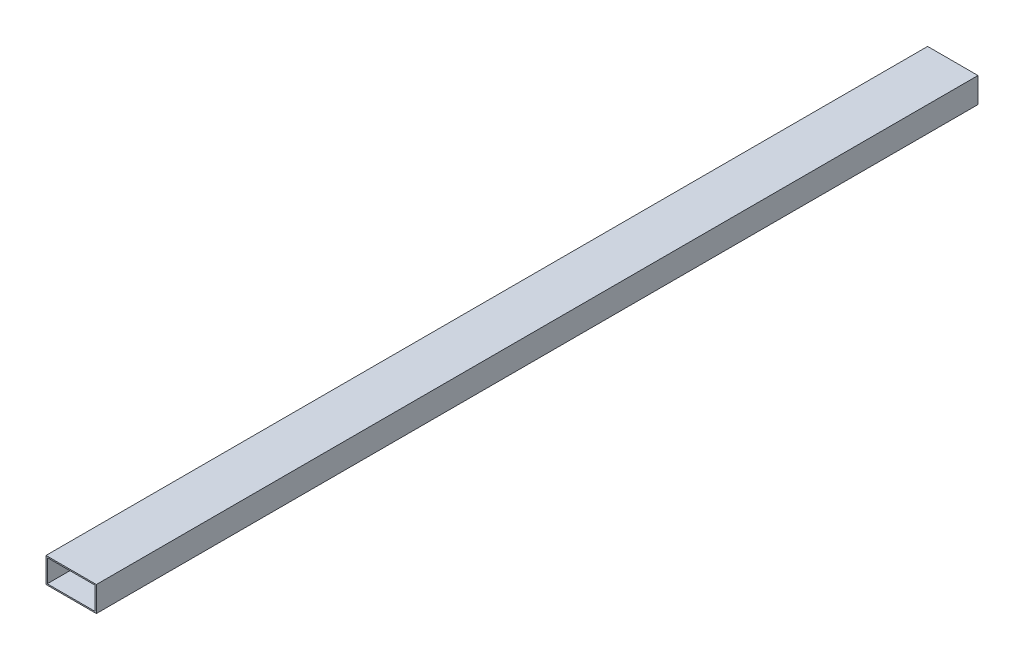
ISO-10303-21;
HEADER;
FILE_DESCRIPTION(('STEP AP214'),'2;1');
FILE_NAME('part.step','',(''),(''),'','','');
FILE_SCHEMA(('AUTOMOTIVE_DESIGN { 1 0 10303 214 1 1 1 1 }'));
ENDSEC;
DATA;
#1=APPLICATION_CONTEXT('core data for automotive mechanical design processes');
#2=APPLICATION_PROTOCOL_DEFINITION('international standard','automotive_design',2000,#1);
#3=PRODUCT_CONTEXT('',#1,'mechanical');
#4=PRODUCT('Part','Part','',(#3));
#5=PRODUCT_RELATED_PRODUCT_CATEGORY('part','',(#4));
#6=PRODUCT_DEFINITION_FORMATION('','',#4);
#7=PRODUCT_DEFINITION_CONTEXT('part definition',#1,'design');
#8=PRODUCT_DEFINITION('design','',#6,#7);
#9=PRODUCT_DEFINITION_SHAPE('','',#8);
#10=(LENGTH_UNIT() NAMED_UNIT(*) SI_UNIT(.MILLI.,.METRE.));
#11=(NAMED_UNIT(*) PLANE_ANGLE_UNIT() SI_UNIT($,.RADIAN.));
#12=(NAMED_UNIT(*) SI_UNIT($,.STERADIAN.) SOLID_ANGLE_UNIT());
#13=UNCERTAINTY_MEASURE_WITH_UNIT(LENGTH_MEASURE(1.E-05),#10,'distance_accuracy_value','');
#14=(GEOMETRIC_REPRESENTATION_CONTEXT(3) GLOBAL_UNCERTAINTY_ASSIGNED_CONTEXT((#13)) GLOBAL_UNIT_ASSIGNED_CONTEXT((#10,
#11,#12)) REPRESENTATION_CONTEXT('',''));
#15=CARTESIAN_POINT('',(0.,0.,0.));
#16=DIRECTION('',(0.,0.,1.));
#17=DIRECTION('',(1.,0.,0.));
#18=AXIS2_PLACEMENT_3D('',#15,#16,#17);
#19=CARTESIAN_POINT('',(-20.,-10.,700.));
#20=DIRECTION('',(1.,0.,0.));
#21=DIRECTION('',(0.,1.,0.));
#22=AXIS2_PLACEMENT_3D('',#19,#20,#21);
#23=PLANE('',#22);
#24=DIRECTION('',(0.,-1.,0.));
#25=VECTOR('',#24,1.);
#26=CARTESIAN_POINT('',(-20.,-10.,0.));
#27=LINE('',#26,#25);
#28=CARTESIAN_POINT('',(-20.,9.99999999999999,0.));
#29=VERTEX_POINT('',#28);
#30=CARTESIAN_POINT('',(-20.,-10.,0.));
#31=VERTEX_POINT('',#30);
#32=EDGE_CURVE('E147',#29,#31,#27,.T.);
#33=ORIENTED_EDGE('',*,*,#32,.T.);
#34=DIRECTION('',(0.,0.,-1.));
#35=VECTOR('',#34,1.);
#36=CARTESIAN_POINT('',(-20.,-10.,700.));
#37=LINE('',#36,#35);
#38=CARTESIAN_POINT('',(-20.,-10.,700.));
#39=VERTEX_POINT('',#38);
#40=EDGE_CURVE('E11',#39,#31,#37,.T.);
#41=ORIENTED_EDGE('',*,*,#40,.F.);
#42=DIRECTION('',(0.,-1.,0.));
#43=VECTOR('',#42,1.);
#44=CARTESIAN_POINT('',(-20.,-10.,700.));
#45=LINE('',#44,#43);
#46=CARTESIAN_POINT('',(-20.,9.99999999999999,700.));
#47=VERTEX_POINT('',#46);
#48=EDGE_CURVE('E153',#47,#39,#45,.T.);
#49=ORIENTED_EDGE('',*,*,#48,.F.);
#50=DIRECTION('',(0.,0.,-1.));
#51=VECTOR('',#50,1.);
#52=CARTESIAN_POINT('',(-20.,9.99999999999999,700.));
#53=LINE('',#52,#51);
#54=EDGE_CURVE('E167',#47,#29,#53,.T.);
#55=ORIENTED_EDGE('',*,*,#54,.T.);
#56=EDGE_LOOP('',(#33,#41,#49,#55));
#57=FACE_BOUND('',#56,.T.);
#58=ADVANCED_FACE('F39',(#57),#23,.F.);
#59=CARTESIAN_POINT('',(20.,-10.,700.));
#60=DIRECTION('',(0.,1.,0.));
#61=DIRECTION('',(-1.,0.,0.));
#62=AXIS2_PLACEMENT_3D('',#59,#60,#61);
#63=PLANE('',#62);
#64=DIRECTION('',(1.,0.,0.));
#65=VECTOR('',#64,1.);
#66=CARTESIAN_POINT('',(20.,-10.,0.));
#67=LINE('',#66,#65);
#68=CARTESIAN_POINT('',(20.,-10.,0.));
#69=VERTEX_POINT('',#68);
#70=EDGE_CURVE('E171',#31,#69,#67,.T.);
#71=ORIENTED_EDGE('',*,*,#70,.T.);
#72=DIRECTION('',(0.,0.,-1.));
#73=VECTOR('',#72,1.);
#74=CARTESIAN_POINT('',(20.,-10.,700.));
#75=LINE('',#74,#73);
#76=CARTESIAN_POINT('',(20.,-10.,700.));
#77=VERTEX_POINT('',#76);
#78=EDGE_CURVE('E47',#77,#69,#75,.T.);
#79=ORIENTED_EDGE('',*,*,#78,.F.);
#80=DIRECTION('',(1.,0.,0.));
#81=VECTOR('',#80,1.);
#82=CARTESIAN_POINT('',(20.,-10.,700.));
#83=LINE('',#82,#81);
#84=EDGE_CURVE('E157',#39,#77,#83,.T.);
#85=ORIENTED_EDGE('',*,*,#84,.F.);
#86=ORIENTED_EDGE('',*,*,#40,.T.);
#87=EDGE_LOOP('',(#71,#79,#85,#86));
#88=FACE_BOUND('',#87,.T.);
#89=ADVANCED_FACE('F205',(#88),#63,.F.);
#90=CARTESIAN_POINT('',(20.,9.99999999999999,700.));
#91=DIRECTION('',(-1.,0.,0.));
#92=DIRECTION('',(0.,-1.,0.));
#93=AXIS2_PLACEMENT_3D('',#90,#91,#92);
#94=PLANE('',#93);
#95=DIRECTION('',(0.,1.,0.));
#96=VECTOR('',#95,1.);
#97=CARTESIAN_POINT('',(20.,9.99999999999999,0.));
#98=LINE('',#97,#96);
#99=CARTESIAN_POINT('',(20.,9.99999999999999,0.));
#100=VERTEX_POINT('',#99);
#101=EDGE_CURVE('E174',#69,#100,#98,.T.);
#102=ORIENTED_EDGE('',*,*,#101,.T.);
#103=DIRECTION('',(0.,0.,-1.));
#104=VECTOR('',#103,1.);
#105=CARTESIAN_POINT('',(20.,9.99999999999999,700.));
#106=LINE('',#105,#104);
#107=CARTESIAN_POINT('',(20.,9.99999999999999,700.));
#108=VERTEX_POINT('',#107);
#109=EDGE_CURVE('E182',#108,#100,#106,.T.);
#110=ORIENTED_EDGE('',*,*,#109,.F.);
#111=DIRECTION('',(0.,1.,0.));
#112=VECTOR('',#111,1.);
#113=CARTESIAN_POINT('',(20.,9.99999999999999,700.));
#114=LINE('',#113,#112);
#115=EDGE_CURVE('E161',#77,#108,#114,.T.);
#116=ORIENTED_EDGE('',*,*,#115,.F.);
#117=ORIENTED_EDGE('',*,*,#78,.T.);
#118=EDGE_LOOP('',(#102,#110,#116,#117));
#119=FACE_BOUND('',#118,.T.);
#120=ADVANCED_FACE('F191',(#119),#94,.F.);
#121=CARTESIAN_POINT('',(-20.,9.99999999999999,700.));
#122=DIRECTION('',(0.,-1.,0.));
#123=DIRECTION('',(0.,0.,-1.));
#124=AXIS2_PLACEMENT_3D('',#121,#122,#123);
#125=PLANE('',#124);
#126=DIRECTION('',(-1.,0.,0.));
#127=VECTOR('',#126,1.);
#128=CARTESIAN_POINT('',(-20.,9.99999999999999,0.));
#129=LINE('',#128,#127);
#130=EDGE_CURVE('E158',#100,#29,#129,.T.);
#131=ORIENTED_EDGE('',*,*,#130,.T.);
#132=ORIENTED_EDGE('',*,*,#54,.F.);
#133=DIRECTION('',(-1.,0.,0.));
#134=VECTOR('',#133,1.);
#135=CARTESIAN_POINT('',(-20.,9.99999999999999,700.));
#136=LINE('',#135,#134);
#137=EDGE_CURVE('E164',#108,#47,#136,.T.);
#138=ORIENTED_EDGE('',*,*,#137,.F.);
#139=ORIENTED_EDGE('',*,*,#109,.T.);
#140=EDGE_LOOP('',(#131,#132,#138,#139));
#141=FACE_BOUND('',#140,.T.);
#142=ADVANCED_FACE('F198',(#141),#125,.F.);
#143=CARTESIAN_POINT('',(0.,0.,700.));
#144=DIRECTION('',(0.,0.,-1.));
#145=DIRECTION('',(-1.,0.,0.));
#146=AXIS2_PLACEMENT_3D('',#143,#144,#145);
#147=PLANE('',#146);
#148=DIRECTION('',(0.,-1.,0.));
#149=VECTOR('',#148,1.);
#150=CARTESIAN_POINT('',(-19.,8.99999999999999,700.));
#151=LINE('',#150,#149);
#152=CARTESIAN_POINT('',(-19.,8.99999999999999,700.));
#153=VERTEX_POINT('',#152);
#154=CARTESIAN_POINT('',(-19.,-9.00000000000001,700.));
#155=VERTEX_POINT('',#154);
#156=EDGE_CURVE('E138',#153,#155,#151,.T.);
#157=ORIENTED_EDGE('',*,*,#156,.F.);
#158=DIRECTION('',(-1.,0.,0.));
#159=VECTOR('',#158,1.);
#160=CARTESIAN_POINT('',(19.,8.99999999999999,700.));
#161=LINE('',#160,#159);
#162=CARTESIAN_POINT('',(19.,8.99999999999999,700.));
#163=VERTEX_POINT('',#162);
#164=EDGE_CURVE('E54',#163,#153,#161,.T.);
#165=ORIENTED_EDGE('',*,*,#164,.F.);
#166=DIRECTION('',(0.,1.,0.));
#167=VECTOR('',#166,1.);
#168=CARTESIAN_POINT('',(19.,-9.,700.));
#169=LINE('',#168,#167);
#170=CARTESIAN_POINT('',(19.,-9.,700.));
#171=VERTEX_POINT('',#170);
#172=EDGE_CURVE('E125',#171,#163,#169,.T.);
#173=ORIENTED_EDGE('',*,*,#172,.F.);
#174=DIRECTION('',(1.,0.,0.));
#175=VECTOR('',#174,1.);
#176=CARTESIAN_POINT('',(-19.,-9.00000000000001,700.));
#177=LINE('',#176,#175);
#178=EDGE_CURVE('E129',#155,#171,#177,.T.);
#179=ORIENTED_EDGE('',*,*,#178,.F.);
#180=EDGE_LOOP('',(#157,#165,#173,#179));
#181=FACE_BOUND('',#180,.T.);
#182=ORIENTED_EDGE('',*,*,#48,.T.);
#183=ORIENTED_EDGE('',*,*,#84,.T.);
#184=ORIENTED_EDGE('',*,*,#115,.T.);
#185=ORIENTED_EDGE('',*,*,#137,.T.);
#186=EDGE_LOOP('',(#182,#183,#184,#185));
#187=FACE_BOUND('',#186,.T.);
#188=ADVANCED_FACE('F204',(#181,#187),#147,.F.);
#189=CARTESIAN_POINT('',(0.,0.,0.));
#190=DIRECTION('',(0.,0.,-1.));
#191=DIRECTION('',(-1.,0.,0.));
#192=AXIS2_PLACEMENT_3D('',#189,#190,#191);
#193=PLANE('',#192);
#194=DIRECTION('',(-1.,0.,0.));
#195=VECTOR('',#194,1.);
#196=CARTESIAN_POINT('',(19.,8.99999999999999,0.));
#197=LINE('',#196,#195);
#198=CARTESIAN_POINT('',(19.,8.99999999999999,0.));
#199=VERTEX_POINT('',#198);
#200=CARTESIAN_POINT('',(-19.,8.99999999999999,0.));
#201=VERTEX_POINT('',#200);
#202=EDGE_CURVE('E106',#199,#201,#197,.T.);
#203=ORIENTED_EDGE('',*,*,#202,.T.);
#204=DIRECTION('',(0.,-1.,0.));
#205=VECTOR('',#204,1.);
#206=CARTESIAN_POINT('',(-19.,8.99999999999999,0.));
#207=LINE('',#206,#205);
#208=CARTESIAN_POINT('',(-19.,-9.00000000000001,0.));
#209=VERTEX_POINT('',#208);
#210=EDGE_CURVE('E116',#201,#209,#207,.T.);
#211=ORIENTED_EDGE('',*,*,#210,.T.);
#212=DIRECTION('',(1.,0.,0.));
#213=VECTOR('',#212,1.);
#214=CARTESIAN_POINT('',(-19.,-9.00000000000001,0.));
#215=LINE('',#214,#213);
#216=CARTESIAN_POINT('',(19.,-9.,0.));
#217=VERTEX_POINT('',#216);
#218=EDGE_CURVE('E62',#209,#217,#215,.T.);
#219=ORIENTED_EDGE('',*,*,#218,.T.);
#220=DIRECTION('',(0.,1.,0.));
#221=VECTOR('',#220,1.);
#222=CARTESIAN_POINT('',(19.,-9.,0.));
#223=LINE('',#222,#221);
#224=EDGE_CURVE('E113',#217,#199,#223,.T.);
#225=ORIENTED_EDGE('',*,*,#224,.T.);
#226=EDGE_LOOP('',(#203,#211,#219,#225));
#227=FACE_BOUND('',#226,.T.);
#228=ORIENTED_EDGE('',*,*,#32,.F.);
#229=ORIENTED_EDGE('',*,*,#130,.F.);
#230=ORIENTED_EDGE('',*,*,#101,.F.);
#231=ORIENTED_EDGE('',*,*,#70,.F.);
#232=EDGE_LOOP('',(#228,#229,#230,#231));
#233=FACE_BOUND('',#232,.T.);
#234=ADVANCED_FACE('F121',(#227,#233),#193,.T.);
#235=CARTESIAN_POINT('',(19.,8.99999999999999,0.));
#236=DIRECTION('',(0.,1.,0.));
#237=DIRECTION('',(0.,0.,1.));
#238=AXIS2_PLACEMENT_3D('',#235,#236,#237);
#239=PLANE('',#238);
#240=ORIENTED_EDGE('',*,*,#164,.T.);
#241=DIRECTION('',(0.,0.,1.));
#242=VECTOR('',#241,1.);
#243=CARTESIAN_POINT('',(-19.,8.99999999999999,0.));
#244=LINE('',#243,#242);
#245=EDGE_CURVE('E102',#201,#153,#244,.T.);
#246=ORIENTED_EDGE('',*,*,#245,.F.);
#247=ORIENTED_EDGE('',*,*,#202,.F.);
#248=DIRECTION('',(0.,0.,1.));
#249=VECTOR('',#248,1.);
#250=CARTESIAN_POINT('',(19.,8.99999999999999,0.));
#251=LINE('',#250,#249);
#252=EDGE_CURVE('E144',#199,#163,#251,.T.);
#253=ORIENTED_EDGE('',*,*,#252,.T.);
#254=EDGE_LOOP('',(#240,#246,#247,#253));
#255=FACE_BOUND('',#254,.T.);
#256=ADVANCED_FACE('F104',(#255),#239,.F.);
#257=CARTESIAN_POINT('',(19.,-9.,0.));
#258=DIRECTION('',(1.,0.,0.));
#259=DIRECTION('',(0.,1.,0.));
#260=AXIS2_PLACEMENT_3D('',#257,#258,#259);
#261=PLANE('',#260);
#262=ORIENTED_EDGE('',*,*,#172,.T.);
#263=ORIENTED_EDGE('',*,*,#252,.F.);
#264=ORIENTED_EDGE('',*,*,#224,.F.);
#265=DIRECTION('',(0.,0.,1.));
#266=VECTOR('',#265,1.);
#267=CARTESIAN_POINT('',(19.,-9.,0.));
#268=LINE('',#267,#266);
#269=EDGE_CURVE('E148',#217,#171,#268,.T.);
#270=ORIENTED_EDGE('',*,*,#269,.T.);
#271=EDGE_LOOP('',(#262,#263,#264,#270));
#272=FACE_BOUND('',#271,.T.);
#273=ADVANCED_FACE('F222',(#272),#261,.F.);
#274=CARTESIAN_POINT('',(-19.,-9.00000000000001,0.));
#275=DIRECTION('',(0.,-1.,0.));
#276=DIRECTION('',(1.,0.,0.));
#277=AXIS2_PLACEMENT_3D('',#274,#275,#276);
#278=PLANE('',#277);
#279=ORIENTED_EDGE('',*,*,#178,.T.);
#280=ORIENTED_EDGE('',*,*,#269,.F.);
#281=ORIENTED_EDGE('',*,*,#218,.F.);
#282=DIRECTION('',(0.,0.,1.));
#283=VECTOR('',#282,1.);
#284=CARTESIAN_POINT('',(-19.,-9.00000000000001,0.));
#285=LINE('',#284,#283);
#286=EDGE_CURVE('E112',#209,#155,#285,.T.);
#287=ORIENTED_EDGE('',*,*,#286,.T.);
#288=EDGE_LOOP('',(#279,#280,#281,#287));
#289=FACE_BOUND('',#288,.T.);
#290=ADVANCED_FACE('F225',(#289),#278,.F.);
#291=CARTESIAN_POINT('',(-19.,8.99999999999999,0.));
#292=DIRECTION('',(-1.,0.,0.));
#293=DIRECTION('',(0.,-1.,0.));
#294=AXIS2_PLACEMENT_3D('',#291,#292,#293);
#295=PLANE('',#294);
#296=ORIENTED_EDGE('',*,*,#156,.T.);
#297=ORIENTED_EDGE('',*,*,#286,.F.);
#298=ORIENTED_EDGE('',*,*,#210,.F.);
#299=ORIENTED_EDGE('',*,*,#245,.T.);
#300=EDGE_LOOP('',(#296,#297,#298,#299));
#301=FACE_BOUND('',#300,.T.);
#302=ADVANCED_FACE('F117',(#301),#295,.F.);
#303=CLOSED_SHELL('',(#58,#89,#120,#142,#188,#234,#256,#273,#290,#302));
#304=MANIFOLD_SOLID_BREP('B2',#303);
#305=ADVANCED_BREP_SHAPE_REPRESENTATION('',(#18,#304),#14);
#306=SHAPE_DEFINITION_REPRESENTATION(#9,#305);
ENDSEC;
END-ISO-10303-21;
